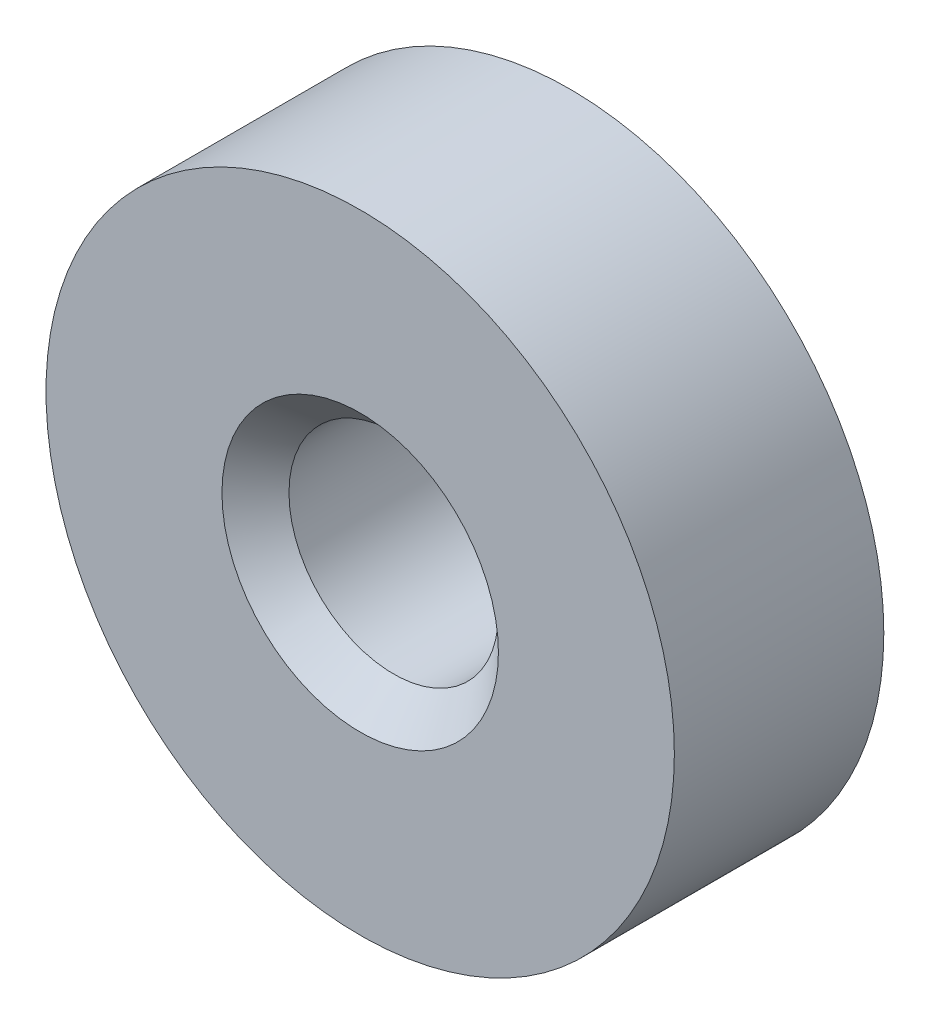
ISO-10303-21;
HEADER;
FILE_DESCRIPTION(('STEP AP214'),'2;1');
FILE_NAME('part.step','',(''),(''),'','','');
FILE_SCHEMA(('AUTOMOTIVE_DESIGN { 1 0 10303 214 1 1 1 1 }'));
ENDSEC;
DATA;
#1=APPLICATION_CONTEXT('core data for automotive mechanical design processes');
#2=APPLICATION_PROTOCOL_DEFINITION('international standard','automotive_design',2000,#1);
#3=PRODUCT_CONTEXT('',#1,'mechanical');
#4=PRODUCT('Part','Part','',(#3));
#5=PRODUCT_RELATED_PRODUCT_CATEGORY('part','',(#4));
#6=PRODUCT_DEFINITION_FORMATION('','',#4);
#7=PRODUCT_DEFINITION_CONTEXT('part definition',#1,'design');
#8=PRODUCT_DEFINITION('design','',#6,#7);
#9=PRODUCT_DEFINITION_SHAPE('','',#8);
#10=(LENGTH_UNIT() NAMED_UNIT(*) SI_UNIT(.MILLI.,.METRE.));
#11=(NAMED_UNIT(*) PLANE_ANGLE_UNIT() SI_UNIT($,.RADIAN.));
#12=(NAMED_UNIT(*) SI_UNIT($,.STERADIAN.) SOLID_ANGLE_UNIT());
#13=UNCERTAINTY_MEASURE_WITH_UNIT(LENGTH_MEASURE(1.E-05),#10,'distance_accuracy_value','');
#14=(GEOMETRIC_REPRESENTATION_CONTEXT(3) GLOBAL_UNCERTAINTY_ASSIGNED_CONTEXT((#13)) GLOBAL_UNIT_ASSIGNED_CONTEXT((#10,
#11,#12)) REPRESENTATION_CONTEXT('',''));
#15=CARTESIAN_POINT('',(0.,0.,0.));
#16=DIRECTION('',(0.,0.,1.));
#17=DIRECTION('',(1.,0.,0.));
#18=AXIS2_PLACEMENT_3D('',#15,#16,#17);
#19=CARTESIAN_POINT('',(0.,0.,9.525));
#20=DIRECTION('',(0.,0.,1.));
#21=DIRECTION('',(1.,0.,0.));
#22=AXIS2_PLACEMENT_3D('',#19,#20,#21);
#23=PLANE('',#22);
#24=CARTESIAN_POINT('',(0.,0.,9.525));
#25=DIRECTION('',(0.,0.,1.));
#26=DIRECTION('',(1.,0.,0.));
#27=AXIS2_PLACEMENT_3D('',#24,#25,#26);
#28=CIRCLE('',#27,6.28650000000001);
#29=CARTESIAN_POINT('',(6.28650000000001,0.,9.525));
#30=VERTEX_POINT('',#29);
#31=EDGE_CURVE('E10',#30,#30,#28,.F.);
#32=ORIENTED_EDGE('',*,*,#31,.T.);
#33=EDGE_LOOP('',(#32));
#34=FACE_BOUND('',#33,.T.);
#35=CARTESIAN_POINT('',(0.,0.,9.525));
#36=DIRECTION('',(0.,0.,1.));
#37=DIRECTION('',(1.,0.,0.));
#38=AXIS2_PLACEMENT_3D('',#35,#36,#37);
#39=CIRCLE('',#38,14.2875);
#40=CARTESIAN_POINT('',(14.2875,0.,9.525));
#41=VERTEX_POINT('',#40);
#42=EDGE_CURVE('E55',#41,#41,#39,.T.);
#43=ORIENTED_EDGE('',*,*,#42,.T.);
#44=EDGE_LOOP('',(#43));
#45=FACE_BOUND('',#44,.T.);
#46=ADVANCED_FACE('F35',(#34,#45),#23,.T.);
#47=CARTESIAN_POINT('',(0.,0.,0.));
#48=DIRECTION('',(0.,0.,1.));
#49=DIRECTION('',(1.,0.,0.));
#50=AXIS2_PLACEMENT_3D('',#47,#48,#49);
#51=PLANE('',#50);
#52=CARTESIAN_POINT('',(0.,0.,0.));
#53=DIRECTION('',(0.,0.,1.));
#54=DIRECTION('',(1.,0.,0.));
#55=AXIS2_PLACEMENT_3D('',#52,#53,#54);
#56=CIRCLE('',#55,6.28649999999998);
#57=CARTESIAN_POINT('',(6.28649999999998,0.,0.));
#58=VERTEX_POINT('',#57);
#59=EDGE_CURVE('E50',#58,#58,#56,.T.);
#60=ORIENTED_EDGE('',*,*,#59,.T.);
#61=EDGE_LOOP('',(#60));
#62=FACE_BOUND('',#61,.T.);
#63=CARTESIAN_POINT('',(0.,0.,0.));
#64=DIRECTION('',(0.,0.,1.));
#65=DIRECTION('',(1.,0.,0.));
#66=AXIS2_PLACEMENT_3D('',#63,#64,#65);
#67=CIRCLE('',#66,14.2875);
#68=CARTESIAN_POINT('',(14.2875,0.,0.));
#69=VERTEX_POINT('',#68);
#70=EDGE_CURVE('E56',#69,#69,#67,.T.);
#71=ORIENTED_EDGE('',*,*,#70,.F.);
#72=EDGE_LOOP('',(#71));
#73=FACE_BOUND('',#72,.T.);
#74=ADVANCED_FACE('F67',(#62,#73),#51,.F.);
#75=CARTESIAN_POINT('',(0.,0.,9.525));
#76=DIRECTION('',(0.,0.,-1.));
#77=DIRECTION('',(-1.,0.,0.));
#78=AXIS2_PLACEMENT_3D('',#75,#76,#77);
#79=CYLINDRICAL_SURFACE('',#78,14.2875);
#80=ORIENTED_EDGE('',*,*,#42,.F.);
#81=EDGE_LOOP('',(#80));
#82=FACE_BOUND('',#81,.T.);
#83=ORIENTED_EDGE('',*,*,#70,.T.);
#84=EDGE_LOOP('',(#83));
#85=FACE_BOUND('',#84,.T.);
#86=ADVANCED_FACE('F63',(#82,#85),#79,.T.);
#87=CARTESIAN_POINT('',(0.,0.,9.525));
#88=DIRECTION('',(0.,0.,-1.));
#89=DIRECTION('',(-1.,0.,0.));
#90=AXIS2_PLACEMENT_3D('',#87,#88,#89);
#91=CYLINDRICAL_SURFACE('',#90,4.7625);
#92=CARTESIAN_POINT('',(0.,0.,1.52399999999999));
#93=DIRECTION('',(0.,0.,1.));
#94=DIRECTION('',(1.,0.,0.));
#95=AXIS2_PLACEMENT_3D('',#92,#93,#94);
#96=CIRCLE('',#95,4.7625);
#97=CARTESIAN_POINT('',(4.7625,0.,1.52399999999999));
#98=VERTEX_POINT('',#97);
#99=EDGE_CURVE('E42',#98,#98,#96,.F.);
#100=ORIENTED_EDGE('',*,*,#99,.T.);
#101=EDGE_LOOP('',(#100));
#102=FACE_BOUND('',#101,.T.);
#103=CARTESIAN_POINT('',(0.,0.,8.00099999999999));
#104=DIRECTION('',(0.,0.,1.));
#105=DIRECTION('',(1.,0.,0.));
#106=AXIS2_PLACEMENT_3D('',#103,#104,#105);
#107=CIRCLE('',#106,4.7625);
#108=CARTESIAN_POINT('',(4.7625,0.,8.00099999999999));
#109=VERTEX_POINT('',#108);
#110=EDGE_CURVE('E46',#109,#109,#107,.T.);
#111=ORIENTED_EDGE('',*,*,#110,.T.);
#112=EDGE_LOOP('',(#111));
#113=FACE_BOUND('',#112,.T.);
#114=ADVANCED_FACE('F66',(#102,#113),#91,.F.);
#115=CARTESIAN_POINT('',(0.,0.,0.));
#116=DIRECTION('',(0.,0.,-1.));
#117=DIRECTION('',(-1.,0.,0.));
#118=AXIS2_PLACEMENT_3D('',#115,#116,#117);
#119=CONICAL_SURFACE('',#118,6.28649999999998,0.785398163397447);
#120=ORIENTED_EDGE('',*,*,#99,.F.);
#121=EDGE_LOOP('',(#120));
#122=FACE_BOUND('',#121,.T.);
#123=ORIENTED_EDGE('',*,*,#59,.F.);
#124=EDGE_LOOP('',(#123));
#125=FACE_BOUND('',#124,.T.);
#126=ADVANCED_FACE('F79',(#122,#125),#119,.F.);
#127=CARTESIAN_POINT('',(0.,0.,8.00099999999999));
#128=DIRECTION('',(0.,0.,1.));
#129=DIRECTION('',(1.,0.,0.));
#130=AXIS2_PLACEMENT_3D('',#127,#128,#129);
#131=CONICAL_SURFACE('',#130,4.7625,0.785398163397451);
#132=ORIENTED_EDGE('',*,*,#31,.F.);
#133=EDGE_LOOP('',(#132));
#134=FACE_BOUND('',#133,.T.);
#135=ORIENTED_EDGE('',*,*,#110,.F.);
#136=EDGE_LOOP('',(#135));
#137=FACE_BOUND('',#136,.T.);
#138=ADVANCED_FACE('F37',(#134,#137),#131,.F.);
#139=CLOSED_SHELL('',(#46,#74,#86,#114,#126,#138));
#140=MANIFOLD_SOLID_BREP('B2',#139);
#141=ADVANCED_BREP_SHAPE_REPRESENTATION('',(#18,#140),#14);
#142=SHAPE_DEFINITION_REPRESENTATION(#9,#141);
ENDSEC;
END-ISO-10303-21;
